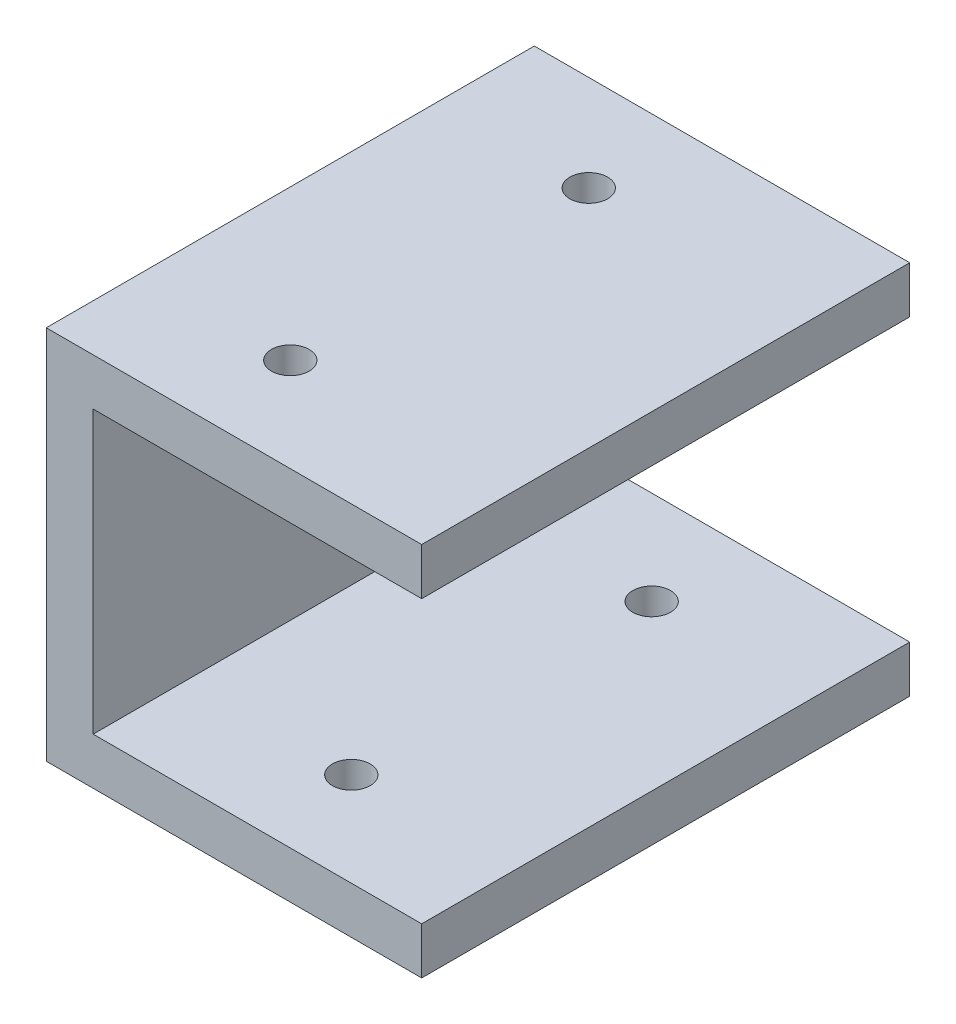
ISO-10303-21;
HEADER;
FILE_DESCRIPTION(('STEP AP214'),'2;1');
FILE_NAME('part.step','',(''),(''),'','','');
FILE_SCHEMA(('AUTOMOTIVE_DESIGN { 1 0 10303 214 1 1 1 1 }'));
ENDSEC;
DATA;
#1=APPLICATION_CONTEXT('core data for automotive mechanical design processes');
#2=APPLICATION_PROTOCOL_DEFINITION('international standard','automotive_design',2000,#1);
#3=PRODUCT_CONTEXT('',#1,'mechanical');
#4=PRODUCT('Part','Part','',(#3));
#5=PRODUCT_RELATED_PRODUCT_CATEGORY('part','',(#4));
#6=PRODUCT_DEFINITION_FORMATION('','',#4);
#7=PRODUCT_DEFINITION_CONTEXT('part definition',#1,'design');
#8=PRODUCT_DEFINITION('design','',#6,#7);
#9=PRODUCT_DEFINITION_SHAPE('','',#8);
#10=(LENGTH_UNIT() NAMED_UNIT(*) SI_UNIT(.MILLI.,.METRE.));
#11=(NAMED_UNIT(*) PLANE_ANGLE_UNIT() SI_UNIT($,.RADIAN.));
#12=(NAMED_UNIT(*) SI_UNIT($,.STERADIAN.) SOLID_ANGLE_UNIT());
#13=UNCERTAINTY_MEASURE_WITH_UNIT(LENGTH_MEASURE(1.E-05),#10,'distance_accuracy_value','');
#14=(GEOMETRIC_REPRESENTATION_CONTEXT(3) GLOBAL_UNCERTAINTY_ASSIGNED_CONTEXT((#13)) GLOBAL_UNIT_ASSIGNED_CONTEXT((#10,
#11,#12)) REPRESENTATION_CONTEXT('',''));
#15=CARTESIAN_POINT('',(0.,0.,0.));
#16=DIRECTION('',(0.,0.,1.));
#17=DIRECTION('',(1.,0.,0.));
#18=AXIS2_PLACEMENT_3D('',#15,#16,#17);
#19=CARTESIAN_POINT('',(-25.0858093653435,-19.2669360589494,-66.04));
#20=DIRECTION('',(-1.,0.,0.));
#21=DIRECTION('',(0.,-1.,0.));
#22=AXIS2_PLACEMENT_3D('',#19,#20,#21);
#23=PLANE('',#22);
#24=DIRECTION('',(0.,-1.,0.));
#25=VECTOR('',#24,1.);
#26=CARTESIAN_POINT('',(-25.0858093653435,-19.2669360589494,0.));
#27=LINE('',#26,#25);
#28=CARTESIAN_POINT('',(-25.0858093653435,-19.2669360589494,0.));
#29=VERTEX_POINT('',#28);
#30=CARTESIAN_POINT('',(-25.0858093653435,-70.0669360589494,0.));
#31=VERTEX_POINT('',#30);
#32=EDGE_CURVE('E134',#29,#31,#27,.T.);
#33=ORIENTED_EDGE('',*,*,#32,.F.);
#34=DIRECTION('',(0.,0.,1.));
#35=VECTOR('',#34,1.);
#36=CARTESIAN_POINT('',(-25.0858093653435,-19.2669360589494,-66.04));
#37=LINE('',#36,#35);
#38=CARTESIAN_POINT('',(-25.0858093653435,-19.2669360589494,-66.04));
#39=VERTEX_POINT('',#38);
#40=EDGE_CURVE('E11',#39,#29,#37,.T.);
#41=ORIENTED_EDGE('',*,*,#40,.F.);
#42=DIRECTION('',(0.,-1.,0.));
#43=VECTOR('',#42,1.);
#44=CARTESIAN_POINT('',(-25.0858093653435,-19.2669360589494,-66.04));
#45=LINE('',#44,#43);
#46=CARTESIAN_POINT('',(-25.0858093653435,-70.0669360589494,-66.04));
#47=VERTEX_POINT('',#46);
#48=EDGE_CURVE('E155',#39,#47,#45,.T.);
#49=ORIENTED_EDGE('',*,*,#48,.T.);
#50=DIRECTION('',(0.,0.,1.));
#51=VECTOR('',#50,1.);
#52=CARTESIAN_POINT('',(-25.0858093653435,-70.0669360589494,-66.04));
#53=LINE('',#52,#51);
#54=EDGE_CURVE('E40',#47,#31,#53,.T.);
#55=ORIENTED_EDGE('',*,*,#54,.T.);
#56=EDGE_LOOP('',(#33,#41,#49,#55));
#57=FACE_BOUND('',#56,.T.);
#58=ADVANCED_FACE('F37',(#57),#23,.T.);
#59=CARTESIAN_POINT('',(-25.0858093653435,-19.2669360589494,-66.04));
#60=DIRECTION('',(0.,1.,0.));
#61=DIRECTION('',(0.,0.,1.));
#62=AXIS2_PLACEMENT_3D('',#59,#60,#61);
#63=PLANE('',#62);
#64=CARTESIAN_POINT('',(-4.76580936534095,-19.2669360589494,-53.0860000000001));
#65=DIRECTION('',(0.,1.,0.));
#66=DIRECTION('',(0.,0.,1.));
#67=AXIS2_PLACEMENT_3D('',#64,#65,#66);
#68=CIRCLE('',#67,2.5527);
#69=CARTESIAN_POINT('',(-4.76580936534095,-19.2669360589494,-50.5333000000001));
#70=VERTEX_POINT('',#69);
#71=EDGE_CURVE('E212',#70,#70,#68,.T.);
#72=ORIENTED_EDGE('',*,*,#71,.F.);
#73=EDGE_LOOP('',(#72));
#74=FACE_BOUND('',#73,.T.);
#75=CARTESIAN_POINT('',(-4.76580936534095,-19.2669360589494,-12.7000000000001));
#76=DIRECTION('',(0.,1.,0.));
#77=DIRECTION('',(0.,0.,1.));
#78=AXIS2_PLACEMENT_3D('',#75,#76,#77);
#79=CIRCLE('',#78,2.5527);
#80=CARTESIAN_POINT('',(-4.76580936534095,-19.2669360589494,-10.1473000000001));
#81=VERTEX_POINT('',#80);
#82=EDGE_CURVE('E223',#81,#81,#79,.T.);
#83=ORIENTED_EDGE('',*,*,#82,.F.);
#84=EDGE_LOOP('',(#83));
#85=FACE_BOUND('',#84,.T.);
#86=DIRECTION('',(-1.,0.,0.));
#87=VECTOR('',#86,1.);
#88=CARTESIAN_POINT('',(-25.0858093653435,-19.2669360589494,0.));
#89=LINE('',#88,#87);
#90=CARTESIAN_POINT('',(25.7141906346565,-19.2669360589494,0.));
#91=VERTEX_POINT('',#90);
#92=EDGE_CURVE('E153',#91,#29,#89,.T.);
#93=ORIENTED_EDGE('',*,*,#92,.F.);
#94=DIRECTION('',(0.,0.,1.));
#95=VECTOR('',#94,1.);
#96=CARTESIAN_POINT('',(25.7141906346565,-19.2669360589494,-66.04));
#97=LINE('',#96,#95);
#98=CARTESIAN_POINT('',(25.7141906346565,-19.2669360589494,-66.04));
#99=VERTEX_POINT('',#98);
#100=EDGE_CURVE('E46',#99,#91,#97,.T.);
#101=ORIENTED_EDGE('',*,*,#100,.F.);
#102=DIRECTION('',(-1.,0.,0.));
#103=VECTOR('',#102,1.);
#104=CARTESIAN_POINT('',(-25.0858093653435,-19.2669360589494,-66.04));
#105=LINE('',#104,#103);
#106=EDGE_CURVE('E124',#99,#39,#105,.T.);
#107=ORIENTED_EDGE('',*,*,#106,.T.);
#108=ORIENTED_EDGE('',*,*,#40,.T.);
#109=EDGE_LOOP('',(#93,#101,#107,#108));
#110=FACE_BOUND('',#109,.T.);
#111=ADVANCED_FACE('F167',(#74,#85,#110),#63,.T.);
#112=CARTESIAN_POINT('',(25.7141906346565,-19.2669360589494,-66.04));
#113=DIRECTION('',(1.,0.,0.));
#114=DIRECTION('',(0.,1.,0.));
#115=AXIS2_PLACEMENT_3D('',#112,#113,#114);
#116=PLANE('',#115);
#117=DIRECTION('',(0.,1.,0.));
#118=VECTOR('',#117,1.);
#119=CARTESIAN_POINT('',(25.7141906346565,-19.2669360589494,0.));
#120=LINE('',#119,#118);
#121=CARTESIAN_POINT('',(25.7141906346565,-25.6169360589494,0.));
#122=VERTEX_POINT('',#121);
#123=EDGE_CURVE('E111',#122,#91,#120,.T.);
#124=ORIENTED_EDGE('',*,*,#123,.F.);
#125=DIRECTION('',(0.,0.,1.));
#126=VECTOR('',#125,1.);
#127=CARTESIAN_POINT('',(25.7141906346565,-25.6169360589494,-66.04));
#128=LINE('',#127,#126);
#129=CARTESIAN_POINT('',(25.7141906346565,-25.6169360589494,-66.04));
#130=VERTEX_POINT('',#129);
#131=EDGE_CURVE('E106',#130,#122,#128,.T.);
#132=ORIENTED_EDGE('',*,*,#131,.F.);
#133=DIRECTION('',(0.,1.,0.));
#134=VECTOR('',#133,1.);
#135=CARTESIAN_POINT('',(25.7141906346565,-19.2669360589494,-66.04));
#136=LINE('',#135,#134);
#137=EDGE_CURVE('E109',#130,#99,#136,.T.);
#138=ORIENTED_EDGE('',*,*,#137,.T.);
#139=ORIENTED_EDGE('',*,*,#100,.T.);
#140=EDGE_LOOP('',(#124,#132,#138,#139));
#141=FACE_BOUND('',#140,.T.);
#142=ADVANCED_FACE('F108',(#141),#116,.T.);
#143=CARTESIAN_POINT('',(-18.7358093653435,-25.6169360589494,-66.04));
#144=DIRECTION('',(0.,-1.,0.));
#145=DIRECTION('',(0.,0.,-1.));
#146=AXIS2_PLACEMENT_3D('',#143,#144,#145);
#147=PLANE('',#146);
#148=CARTESIAN_POINT('',(-4.76580936534095,-25.6169360589494,-53.0860000000001));
#149=DIRECTION('',(0.,-1.,0.));
#150=DIRECTION('',(0.,0.,-1.));
#151=AXIS2_PLACEMENT_3D('',#148,#149,#150);
#152=CIRCLE('',#151,2.5527);
#153=CARTESIAN_POINT('',(-4.76580936534095,-25.6169360589494,-55.6387000000001));
#154=VERTEX_POINT('',#153);
#155=EDGE_CURVE('E220',#154,#154,#152,.T.);
#156=ORIENTED_EDGE('',*,*,#155,.F.);
#157=EDGE_LOOP('',(#156));
#158=FACE_BOUND('',#157,.T.);
#159=CARTESIAN_POINT('',(-4.76580936534095,-25.6169360589494,-12.7000000000001));
#160=DIRECTION('',(0.,-1.,0.));
#161=DIRECTION('',(0.,0.,-1.));
#162=AXIS2_PLACEMENT_3D('',#159,#160,#161);
#163=CIRCLE('',#162,2.5527);
#164=CARTESIAN_POINT('',(-4.76580936534095,-25.6169360589494,-15.2527000000001));
#165=VERTEX_POINT('',#164);
#166=EDGE_CURVE('E138',#165,#165,#163,.T.);
#167=ORIENTED_EDGE('',*,*,#166,.F.);
#168=EDGE_LOOP('',(#167));
#169=FACE_BOUND('',#168,.T.);
#170=DIRECTION('',(1.,0.,0.));
#171=VECTOR('',#170,1.);
#172=CARTESIAN_POINT('',(-18.7358093653435,-25.6169360589494,0.));
#173=LINE('',#172,#171);
#174=CARTESIAN_POINT('',(-18.7358093653435,-25.6169360589494,0.));
#175=VERTEX_POINT('',#174);
#176=EDGE_CURVE('E150',#175,#122,#173,.T.);
#177=ORIENTED_EDGE('',*,*,#176,.F.);
#178=DIRECTION('',(0.,0.,1.));
#179=VECTOR('',#178,1.);
#180=CARTESIAN_POINT('',(-18.7358093653435,-25.6169360589494,-66.04));
#181=LINE('',#180,#179);
#182=CARTESIAN_POINT('',(-18.7358093653435,-25.6169360589494,-66.04));
#183=VERTEX_POINT('',#182);
#184=EDGE_CURVE('E116',#183,#175,#181,.T.);
#185=ORIENTED_EDGE('',*,*,#184,.F.);
#186=DIRECTION('',(1.,0.,0.));
#187=VECTOR('',#186,1.);
#188=CARTESIAN_POINT('',(-18.7358093653435,-25.6169360589494,-66.04));
#189=LINE('',#188,#187);
#190=EDGE_CURVE('E122',#183,#130,#189,.T.);
#191=ORIENTED_EDGE('',*,*,#190,.T.);
#192=ORIENTED_EDGE('',*,*,#131,.T.);
#193=EDGE_LOOP('',(#177,#185,#191,#192));
#194=FACE_BOUND('',#193,.T.);
#195=ADVANCED_FACE('F126',(#158,#169,#194),#147,.T.);
#196=CARTESIAN_POINT('',(-18.7358093653435,-25.6169360589494,-66.04));
#197=DIRECTION('',(1.,0.,0.));
#198=DIRECTION('',(0.,0.,-1.));
#199=AXIS2_PLACEMENT_3D('',#196,#197,#198);
#200=PLANE('',#199);
#201=DIRECTION('',(0.,1.,0.));
#202=VECTOR('',#201,1.);
#203=CARTESIAN_POINT('',(-18.7358093653435,-25.6169360589494,0.));
#204=LINE('',#203,#202);
#205=CARTESIAN_POINT('',(-18.7358093653435,-63.7169360589494,0.));
#206=VERTEX_POINT('',#205);
#207=EDGE_CURVE('E147',#206,#175,#204,.T.);
#208=ORIENTED_EDGE('',*,*,#207,.F.);
#209=DIRECTION('',(0.,0.,1.));
#210=VECTOR('',#209,1.);
#211=CARTESIAN_POINT('',(-18.7358093653435,-63.7169360589494,-66.04));
#212=LINE('',#211,#210);
#213=CARTESIAN_POINT('',(-18.7358093653435,-63.7169360589494,-66.04));
#214=VERTEX_POINT('',#213);
#215=EDGE_CURVE('E159',#214,#206,#212,.T.);
#216=ORIENTED_EDGE('',*,*,#215,.F.);
#217=DIRECTION('',(0.,1.,0.));
#218=VECTOR('',#217,1.);
#219=CARTESIAN_POINT('',(-18.7358093653435,-25.6169360589494,-66.04));
#220=LINE('',#219,#218);
#221=EDGE_CURVE('E127',#214,#183,#220,.T.);
#222=ORIENTED_EDGE('',*,*,#221,.T.);
#223=ORIENTED_EDGE('',*,*,#184,.T.);
#224=EDGE_LOOP('',(#208,#216,#222,#223));
#225=FACE_BOUND('',#224,.T.);
#226=ADVANCED_FACE('F183',(#225),#200,.T.);
#227=CARTESIAN_POINT('',(-18.7358093653435,-63.7169360589494,-66.04));
#228=DIRECTION('',(0.,1.,0.));
#229=DIRECTION('',(0.,0.,1.));
#230=AXIS2_PLACEMENT_3D('',#227,#228,#229);
#231=PLANE('',#230);
#232=CARTESIAN_POINT('',(3.48919063465653,-63.7169360589494,-53.34));
#233=DIRECTION('',(0.,1.,0.));
#234=DIRECTION('',(0.,0.,1.));
#235=AXIS2_PLACEMENT_3D('',#232,#233,#234);
#236=CIRCLE('',#235,2.5527);
#237=CARTESIAN_POINT('',(3.48919063465653,-63.7169360589494,-50.7873));
#238=VERTEX_POINT('',#237);
#239=EDGE_CURVE('E209',#238,#238,#236,.T.);
#240=ORIENTED_EDGE('',*,*,#239,.F.);
#241=EDGE_LOOP('',(#240));
#242=FACE_BOUND('',#241,.T.);
#243=CARTESIAN_POINT('',(3.48919063465653,-63.7169360589494,-12.7));
#244=DIRECTION('',(0.,1.,0.));
#245=DIRECTION('',(0.,0.,1.));
#246=AXIS2_PLACEMENT_3D('',#243,#244,#245);
#247=CIRCLE('',#246,2.5527);
#248=CARTESIAN_POINT('',(3.48919063465653,-63.7169360589494,-10.1473));
#249=VERTEX_POINT('',#248);
#250=EDGE_CURVE('E208',#249,#249,#247,.T.);
#251=ORIENTED_EDGE('',*,*,#250,.F.);
#252=EDGE_LOOP('',(#251));
#253=FACE_BOUND('',#252,.T.);
#254=DIRECTION('',(-1.,0.,0.));
#255=VECTOR('',#254,1.);
#256=CARTESIAN_POINT('',(-18.7358093653435,-63.7169360589494,0.));
#257=LINE('',#256,#255);
#258=CARTESIAN_POINT('',(25.7141906346565,-63.7169360589494,0.));
#259=VERTEX_POINT('',#258);
#260=EDGE_CURVE('E144',#259,#206,#257,.T.);
#261=ORIENTED_EDGE('',*,*,#260,.F.);
#262=DIRECTION('',(0.,0.,1.));
#263=VECTOR('',#262,1.);
#264=CARTESIAN_POINT('',(25.7141906346565,-63.7169360589494,-66.04));
#265=LINE('',#264,#263);
#266=CARTESIAN_POINT('',(25.7141906346565,-63.7169360589494,-66.04));
#267=VERTEX_POINT('',#266);
#268=EDGE_CURVE('E161',#267,#259,#265,.T.);
#269=ORIENTED_EDGE('',*,*,#268,.F.);
#270=DIRECTION('',(-1.,0.,0.));
#271=VECTOR('',#270,1.);
#272=CARTESIAN_POINT('',(-18.7358093653435,-63.7169360589494,-66.04));
#273=LINE('',#272,#271);
#274=EDGE_CURVE('E129',#267,#214,#273,.T.);
#275=ORIENTED_EDGE('',*,*,#274,.T.);
#276=ORIENTED_EDGE('',*,*,#215,.T.);
#277=EDGE_LOOP('',(#261,#269,#275,#276));
#278=FACE_BOUND('',#277,.T.);
#279=ADVANCED_FACE('F187',(#242,#253,#278),#231,.T.);
#280=CARTESIAN_POINT('',(25.7141906346565,-63.7169360589494,-66.04));
#281=DIRECTION('',(1.,0.,0.));
#282=DIRECTION('',(0.,0.,-1.));
#283=AXIS2_PLACEMENT_3D('',#280,#281,#282);
#284=PLANE('',#283);
#285=DIRECTION('',(0.,1.,0.));
#286=VECTOR('',#285,1.);
#287=CARTESIAN_POINT('',(25.7141906346565,-63.7169360589494,0.));
#288=LINE('',#287,#286);
#289=CARTESIAN_POINT('',(25.7141906346565,-70.0669360589494,0.));
#290=VERTEX_POINT('',#289);
#291=EDGE_CURVE('E141',#290,#259,#288,.T.);
#292=ORIENTED_EDGE('',*,*,#291,.F.);
#293=DIRECTION('',(0.,0.,1.));
#294=VECTOR('',#293,1.);
#295=CARTESIAN_POINT('',(25.7141906346565,-70.0669360589494,-66.04));
#296=LINE('',#295,#294);
#297=CARTESIAN_POINT('',(25.7141906346565,-70.0669360589494,-66.04));
#298=VERTEX_POINT('',#297);
#299=EDGE_CURVE('E162',#298,#290,#296,.T.);
#300=ORIENTED_EDGE('',*,*,#299,.F.);
#301=DIRECTION('',(0.,1.,0.));
#302=VECTOR('',#301,1.);
#303=CARTESIAN_POINT('',(25.7141906346565,-63.7169360589494,-66.04));
#304=LINE('',#303,#302);
#305=EDGE_CURVE('E231',#298,#267,#304,.T.);
#306=ORIENTED_EDGE('',*,*,#305,.T.);
#307=ORIENTED_EDGE('',*,*,#268,.T.);
#308=EDGE_LOOP('',(#292,#300,#306,#307));
#309=FACE_BOUND('',#308,.T.);
#310=ADVANCED_FACE('F191',(#309),#284,.T.);
#311=CARTESIAN_POINT('',(-25.0858093653435,-70.0669360589494,-66.04));
#312=DIRECTION('',(0.,-1.,0.));
#313=DIRECTION('',(0.,0.,-1.));
#314=AXIS2_PLACEMENT_3D('',#311,#312,#313);
#315=PLANE('',#314);
#316=CARTESIAN_POINT('',(3.48919063465653,-70.0669360589494,-53.34));
#317=DIRECTION('',(0.,-1.,0.));
#318=DIRECTION('',(0.,0.,-1.));
#319=AXIS2_PLACEMENT_3D('',#316,#317,#318);
#320=CIRCLE('',#319,2.5527);
#321=CARTESIAN_POINT('',(3.48919063465653,-70.0669360589494,-55.8927));
#322=VERTEX_POINT('',#321);
#323=EDGE_CURVE('E203',#322,#322,#320,.T.);
#324=ORIENTED_EDGE('',*,*,#323,.F.);
#325=EDGE_LOOP('',(#324));
#326=FACE_BOUND('',#325,.T.);
#327=CARTESIAN_POINT('',(3.48919063465653,-70.0669360589494,-12.7));
#328=DIRECTION('',(0.,-1.,0.));
#329=DIRECTION('',(0.,0.,-1.));
#330=AXIS2_PLACEMENT_3D('',#327,#328,#329);
#331=CIRCLE('',#330,2.5527);
#332=CARTESIAN_POINT('',(3.48919063465653,-70.0669360589494,-15.2527));
#333=VERTEX_POINT('',#332);
#334=EDGE_CURVE('E206',#333,#333,#331,.T.);
#335=ORIENTED_EDGE('',*,*,#334,.F.);
#336=EDGE_LOOP('',(#335));
#337=FACE_BOUND('',#336,.T.);
#338=DIRECTION('',(1.,0.,0.));
#339=VECTOR('',#338,1.);
#340=CARTESIAN_POINT('',(-25.0858093653435,-70.0669360589494,0.));
#341=LINE('',#340,#339);
#342=EDGE_CURVE('E137',#31,#290,#341,.T.);
#343=ORIENTED_EDGE('',*,*,#342,.F.);
#344=ORIENTED_EDGE('',*,*,#54,.F.);
#345=DIRECTION('',(1.,0.,0.));
#346=VECTOR('',#345,1.);
#347=CARTESIAN_POINT('',(-25.0858093653435,-70.0669360589494,-66.04));
#348=LINE('',#347,#346);
#349=EDGE_CURVE('E229',#47,#298,#348,.T.);
#350=ORIENTED_EDGE('',*,*,#349,.T.);
#351=ORIENTED_EDGE('',*,*,#299,.T.);
#352=EDGE_LOOP('',(#343,#344,#350,#351));
#353=FACE_BOUND('',#352,.T.);
#354=ADVANCED_FACE('F164',(#326,#337,#353),#315,.T.);
#355=CARTESIAN_POINT('',(0.,0.,-66.04));
#356=DIRECTION('',(0.,0.,1.));
#357=DIRECTION('',(1.,0.,0.));
#358=AXIS2_PLACEMENT_3D('',#355,#356,#357);
#359=PLANE('',#358);
#360=ORIENTED_EDGE('',*,*,#48,.F.);
#361=ORIENTED_EDGE('',*,*,#106,.F.);
#362=ORIENTED_EDGE('',*,*,#137,.F.);
#363=ORIENTED_EDGE('',*,*,#190,.F.);
#364=ORIENTED_EDGE('',*,*,#221,.F.);
#365=ORIENTED_EDGE('',*,*,#274,.F.);
#366=ORIENTED_EDGE('',*,*,#305,.F.);
#367=ORIENTED_EDGE('',*,*,#349,.F.);
#368=EDGE_LOOP('',(#360,#361,#362,#363,#364,#365,#366,#367));
#369=FACE_BOUND('',#368,.T.);
#370=ADVANCED_FACE('F120',(#369),#359,.F.);
#371=CARTESIAN_POINT('',(0.,0.,0.));
#372=DIRECTION('',(0.,0.,1.));
#373=DIRECTION('',(1.,0.,0.));
#374=AXIS2_PLACEMENT_3D('',#371,#372,#373);
#375=PLANE('',#374);
#376=ORIENTED_EDGE('',*,*,#32,.T.);
#377=ORIENTED_EDGE('',*,*,#342,.T.);
#378=ORIENTED_EDGE('',*,*,#291,.T.);
#379=ORIENTED_EDGE('',*,*,#260,.T.);
#380=ORIENTED_EDGE('',*,*,#207,.T.);
#381=ORIENTED_EDGE('',*,*,#176,.T.);
#382=ORIENTED_EDGE('',*,*,#123,.T.);
#383=ORIENTED_EDGE('',*,*,#92,.T.);
#384=EDGE_LOOP('',(#376,#377,#378,#379,#380,#381,#382,#383));
#385=FACE_BOUND('',#384,.T.);
#386=ADVANCED_FACE('F166',(#385),#375,.T.);
#387=CARTESIAN_POINT('',(-4.76580936534095,-19.2669360589494,-12.7000000000001));
#388=DIRECTION('',(0.,1.,0.));
#389=DIRECTION('',(0.,0.,1.));
#390=AXIS2_PLACEMENT_3D('',#387,#388,#389);
#391=CYLINDRICAL_SURFACE('',#390,2.5527);
#392=ORIENTED_EDGE('',*,*,#82,.T.);
#393=EDGE_LOOP('',(#392));
#394=FACE_BOUND('',#393,.T.);
#395=ORIENTED_EDGE('',*,*,#166,.T.);
#396=EDGE_LOOP('',(#395));
#397=FACE_BOUND('',#396,.T.);
#398=ADVANCED_FACE('F241',(#394,#397),#391,.F.);
#399=CARTESIAN_POINT('',(-4.76580936534095,-19.2669360589494,-53.0860000000001));
#400=DIRECTION('',(0.,1.,0.));
#401=DIRECTION('',(0.,0.,1.));
#402=AXIS2_PLACEMENT_3D('',#399,#400,#401);
#403=CYLINDRICAL_SURFACE('',#402,2.5527);
#404=ORIENTED_EDGE('',*,*,#71,.T.);
#405=EDGE_LOOP('',(#404));
#406=FACE_BOUND('',#405,.T.);
#407=ORIENTED_EDGE('',*,*,#155,.T.);
#408=EDGE_LOOP('',(#407));
#409=FACE_BOUND('',#408,.T.);
#410=ADVANCED_FACE('F244',(#406,#409),#403,.F.);
#411=CARTESIAN_POINT('',(3.48919063465653,-70.0669360589494,-12.7));
#412=DIRECTION('',(0.,-1.,0.));
#413=DIRECTION('',(0.,0.,-1.));
#414=AXIS2_PLACEMENT_3D('',#411,#412,#413);
#415=CYLINDRICAL_SURFACE('',#414,2.5527);
#416=ORIENTED_EDGE('',*,*,#334,.T.);
#417=EDGE_LOOP('',(#416));
#418=FACE_BOUND('',#417,.T.);
#419=ORIENTED_EDGE('',*,*,#250,.T.);
#420=EDGE_LOOP('',(#419));
#421=FACE_BOUND('',#420,.T.);
#422=ADVANCED_FACE('F251',(#418,#421),#415,.F.);
#423=CARTESIAN_POINT('',(3.48919063465653,-70.0669360589494,-53.34));
#424=DIRECTION('',(0.,-1.,0.));
#425=DIRECTION('',(0.,0.,-1.));
#426=AXIS2_PLACEMENT_3D('',#423,#424,#425);
#427=CYLINDRICAL_SURFACE('',#426,2.5527);
#428=ORIENTED_EDGE('',*,*,#323,.T.);
#429=EDGE_LOOP('',(#428));
#430=FACE_BOUND('',#429,.T.);
#431=ORIENTED_EDGE('',*,*,#239,.T.);
#432=EDGE_LOOP('',(#431));
#433=FACE_BOUND('',#432,.T.);
#434=ADVANCED_FACE('F257',(#430,#433),#427,.F.);
#435=CLOSED_SHELL('',(#58,#111,#142,#195,#226,#279,#310,#354,#370,#386,#398,#410,#422,#434));
#436=MANIFOLD_SOLID_BREP('B2',#435);
#437=ADVANCED_BREP_SHAPE_REPRESENTATION('',(#18,#436),#14);
#438=SHAPE_DEFINITION_REPRESENTATION(#9,#437);
ENDSEC;
END-ISO-10303-21;
